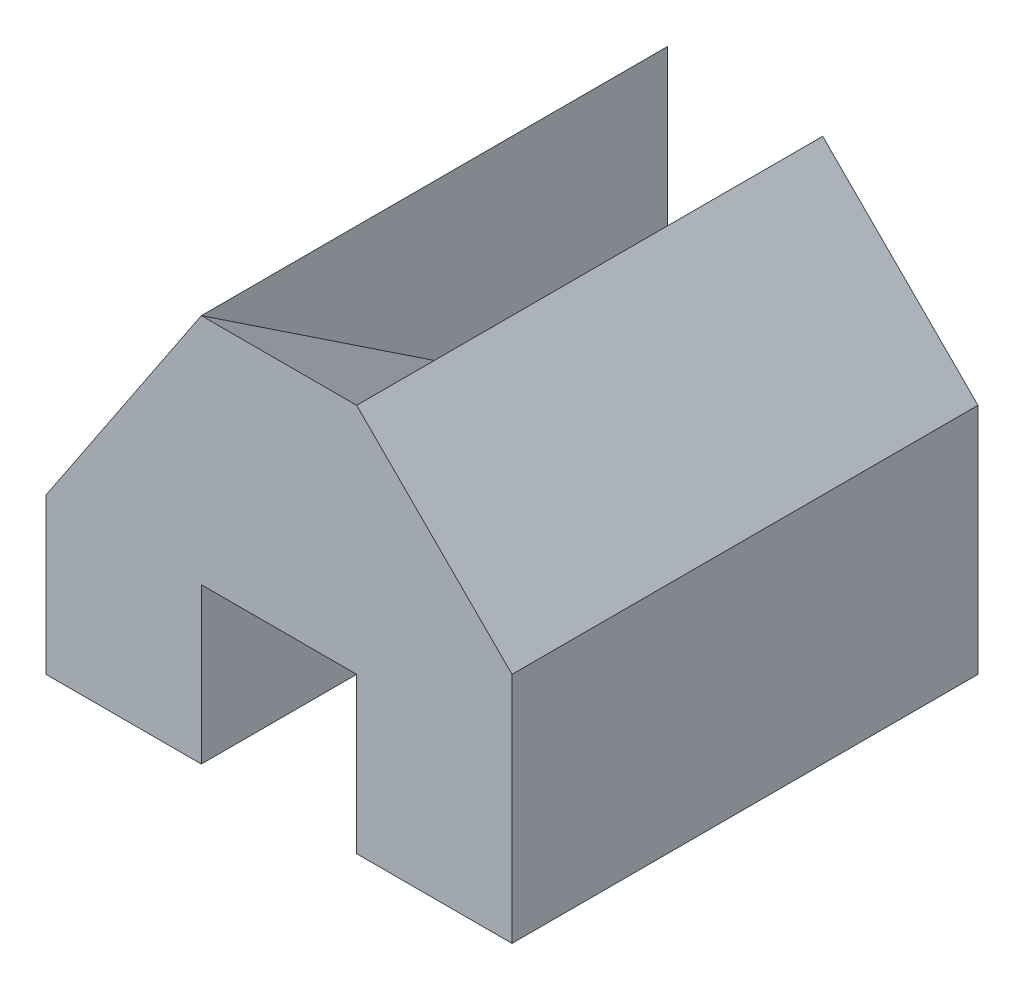
ISO-10303-21;
HEADER;
FILE_DESCRIPTION(('STEP AP214'),'2;1');
FILE_NAME('part.step','',(''),(''),'','','');
FILE_SCHEMA(('AUTOMOTIVE_DESIGN { 1 0 10303 214 1 1 1 1 }'));
ENDSEC;
DATA;
#1=APPLICATION_CONTEXT('core data for automotive mechanical design processes');
#2=APPLICATION_PROTOCOL_DEFINITION('international standard','automotive_design',2000,#1);
#3=PRODUCT_CONTEXT('',#1,'mechanical');
#4=PRODUCT('Part','Part','',(#3));
#5=PRODUCT_RELATED_PRODUCT_CATEGORY('part','',(#4));
#6=PRODUCT_DEFINITION_FORMATION('','',#4);
#7=PRODUCT_DEFINITION_CONTEXT('part definition',#1,'design');
#8=PRODUCT_DEFINITION('design','',#6,#7);
#9=PRODUCT_DEFINITION_SHAPE('','',#8);
#10=(LENGTH_UNIT() NAMED_UNIT(*) SI_UNIT(.MILLI.,.METRE.));
#11=(NAMED_UNIT(*) PLANE_ANGLE_UNIT() SI_UNIT($,.RADIAN.));
#12=(NAMED_UNIT(*) SI_UNIT($,.STERADIAN.) SOLID_ANGLE_UNIT());
#13=UNCERTAINTY_MEASURE_WITH_UNIT(LENGTH_MEASURE(1.E-05),#10,'distance_accuracy_value','');
#14=(GEOMETRIC_REPRESENTATION_CONTEXT(3) GLOBAL_UNCERTAINTY_ASSIGNED_CONTEXT((#13)) GLOBAL_UNIT_ASSIGNED_CONTEXT((#10,
#11,#12)) REPRESENTATION_CONTEXT('',''));
#15=CARTESIAN_POINT('',(0.,0.,0.));
#16=DIRECTION('',(0.,0.,1.));
#17=DIRECTION('',(1.,0.,0.));
#18=AXIS2_PLACEMENT_3D('',#15,#16,#17);
#19=CARTESIAN_POINT('',(-3.,5.,-3.));
#20=DIRECTION('',(0.,0.,1.));
#21=DIRECTION('',(1.,0.,0.));
#22=AXIS2_PLACEMENT_3D('',#19,#20,#21);
#23=PLANE('',#22);
#24=DIRECTION('',(-0.554700196225229,-0.832050294337843,0.));
#25=VECTOR('',#24,1.);
#26=CARTESIAN_POINT('',(-1.61538461538462,4.07692307692308,-3.));
#27=LINE('',#26,#25);
#28=CARTESIAN_POINT('',(-1.,5.,-3.));
#29=VERTEX_POINT('',#28);
#30=CARTESIAN_POINT('',(-3.,2.,-3.));
#31=VERTEX_POINT('',#30);
#32=EDGE_CURVE('E134',#29,#31,#27,.T.);
#33=ORIENTED_EDGE('',*,*,#32,.F.);
#34=DIRECTION('',(0.,1.,0.));
#35=VECTOR('',#34,1.);
#36=CARTESIAN_POINT('',(-1.,0.,-3.));
#37=LINE('',#36,#35);
#38=CARTESIAN_POINT('',(-1.,0.999999999999999,-3.));
#39=VERTEX_POINT('',#38);
#40=EDGE_CURVE('E185',#39,#29,#37,.T.);
#41=ORIENTED_EDGE('',*,*,#40,.F.);
#42=DIRECTION('',(1.,0.,0.));
#43=VECTOR('',#42,1.);
#44=CARTESIAN_POINT('',(-1.,0.999999999999999,-3.));
#45=LINE('',#44,#43);
#46=CARTESIAN_POINT('',(1.,0.999999999999999,-3.));
#47=VERTEX_POINT('',#46);
#48=EDGE_CURVE('E168',#39,#47,#45,.T.);
#49=ORIENTED_EDGE('',*,*,#48,.T.);
#50=DIRECTION('',(0.,1.,0.));
#51=VECTOR('',#50,1.);
#52=CARTESIAN_POINT('',(1.,0.,-3.));
#53=LINE('',#52,#51);
#54=CARTESIAN_POINT('',(1.,5.,-3.));
#55=VERTEX_POINT('',#54);
#56=EDGE_CURVE('E176',#47,#55,#53,.T.);
#57=ORIENTED_EDGE('',*,*,#56,.T.);
#58=DIRECTION('',(0.707106781186548,-0.707106781186548,0.));
#59=VECTOR('',#58,1.);
#60=CARTESIAN_POINT('',(-1.,7.,-3.));
#61=LINE('',#60,#59);
#62=CARTESIAN_POINT('',(3.,3.,-3.));
#63=VERTEX_POINT('',#62);
#64=EDGE_CURVE('E138',#55,#63,#61,.T.);
#65=ORIENTED_EDGE('',*,*,#64,.T.);
#66=DIRECTION('',(0.,-1.,0.));
#67=VECTOR('',#66,1.);
#68=CARTESIAN_POINT('',(3.,5.,-3.));
#69=LINE('',#68,#67);
#70=CARTESIAN_POINT('',(3.,0.,-3.));
#71=VERTEX_POINT('',#70);
#72=EDGE_CURVE('E12',#63,#71,#69,.T.);
#73=ORIENTED_EDGE('',*,*,#72,.T.);
#74=DIRECTION('',(-1.,0.,0.));
#75=VECTOR('',#74,1.);
#76=CARTESIAN_POINT('',(-3.,0.,-3.));
#77=LINE('',#76,#75);
#78=CARTESIAN_POINT('',(1.,0.,-3.));
#79=VERTEX_POINT('',#78);
#80=EDGE_CURVE('E162',#71,#79,#77,.T.);
#81=ORIENTED_EDGE('',*,*,#80,.T.);
#82=DIRECTION('',(1.,0.,0.));
#83=VECTOR('',#82,1.);
#84=CARTESIAN_POINT('',(-1.,0.,-3.));
#85=LINE('',#84,#83);
#86=CARTESIAN_POINT('',(-1.,0.,-3.));
#87=VERTEX_POINT('',#86);
#88=EDGE_CURVE('E182',#87,#79,#85,.T.);
#89=ORIENTED_EDGE('',*,*,#88,.F.);
#90=CARTESIAN_POINT('',(-3.,0.,-3.));
#91=VERTEX_POINT('',#90);
#92=EDGE_CURVE('E165',#87,#91,#77,.T.);
#93=ORIENTED_EDGE('',*,*,#92,.T.);
#94=DIRECTION('',(0.,-1.,0.));
#95=VECTOR('',#94,1.);
#96=CARTESIAN_POINT('',(-3.,5.,-3.));
#97=LINE('',#96,#95);
#98=EDGE_CURVE('E59',#31,#91,#97,.T.);
#99=ORIENTED_EDGE('',*,*,#98,.F.);
#100=EDGE_LOOP('',(#33,#41,#49,#57,#65,#73,#81,#89,#93,#99));
#101=FACE_BOUND('',#100,.T.);
#102=ADVANCED_FACE('F51',(#101),#23,.F.);
#103=CARTESIAN_POINT('',(-3.,5.,3.));
#104=DIRECTION('',(0.,0.,-1.));
#105=DIRECTION('',(-1.,0.,0.));
#106=AXIS2_PLACEMENT_3D('',#103,#104,#105);
#107=PLANE('',#106);
#108=DIRECTION('',(-0.554700196225229,-0.832050294337844,0.));
#109=VECTOR('',#108,1.);
#110=CARTESIAN_POINT('',(-3.,2.,3.));
#111=LINE('',#110,#109);
#112=CARTESIAN_POINT('',(-1.,5.,3.));
#113=VERTEX_POINT('',#112);
#114=CARTESIAN_POINT('',(-3.,2.,3.));
#115=VERTEX_POINT('',#114);
#116=EDGE_CURVE('E131',#113,#115,#111,.T.);
#117=ORIENTED_EDGE('',*,*,#116,.T.);
#118=DIRECTION('',(0.,-1.,0.));
#119=VECTOR('',#118,1.);
#120=CARTESIAN_POINT('',(-3.,5.,3.));
#121=LINE('',#120,#119);
#122=CARTESIAN_POINT('',(-3.,0.,3.));
#123=VERTEX_POINT('',#122);
#124=EDGE_CURVE('E144',#115,#123,#121,.T.);
#125=ORIENTED_EDGE('',*,*,#124,.T.);
#126=DIRECTION('',(1.,0.,0.));
#127=VECTOR('',#126,1.);
#128=CARTESIAN_POINT('',(-3.,0.,3.));
#129=LINE('',#128,#127);
#130=CARTESIAN_POINT('',(-1.,0.,3.));
#131=VERTEX_POINT('',#130);
#132=EDGE_CURVE('E156',#123,#131,#129,.T.);
#133=ORIENTED_EDGE('',*,*,#132,.T.);
#134=DIRECTION('',(0.,-1.,0.));
#135=VECTOR('',#134,1.);
#136=CARTESIAN_POINT('',(-1.,0.,3.));
#137=LINE('',#136,#135);
#138=CARTESIAN_POINT('',(-1.,2.,3.));
#139=VERTEX_POINT('',#138);
#140=EDGE_CURVE('E205',#139,#131,#137,.T.);
#141=ORIENTED_EDGE('',*,*,#140,.F.);
#142=DIRECTION('',(1.,0.,0.));
#143=VECTOR('',#142,1.);
#144=CARTESIAN_POINT('',(-1.,2.,3.));
#145=LINE('',#144,#143);
#146=CARTESIAN_POINT('',(1.,2.,3.));
#147=VERTEX_POINT('',#146);
#148=EDGE_CURVE('E190',#139,#147,#145,.T.);
#149=ORIENTED_EDGE('',*,*,#148,.T.);
#150=DIRECTION('',(0.,-1.,0.));
#151=VECTOR('',#150,1.);
#152=CARTESIAN_POINT('',(1.,0.,3.));
#153=LINE('',#152,#151);
#154=CARTESIAN_POINT('',(1.,0.,3.));
#155=VERTEX_POINT('',#154);
#156=EDGE_CURVE('E199',#147,#155,#153,.T.);
#157=ORIENTED_EDGE('',*,*,#156,.T.);
#158=CARTESIAN_POINT('',(3.,0.,3.));
#159=VERTEX_POINT('',#158);
#160=EDGE_CURVE('E160',#155,#159,#129,.T.);
#161=ORIENTED_EDGE('',*,*,#160,.T.);
#162=DIRECTION('',(0.,-1.,0.));
#163=VECTOR('',#162,1.);
#164=CARTESIAN_POINT('',(3.,5.,3.));
#165=LINE('',#164,#163);
#166=CARTESIAN_POINT('',(3.,3.,3.));
#167=VERTEX_POINT('',#166);
#168=EDGE_CURVE('E74',#167,#159,#165,.T.);
#169=ORIENTED_EDGE('',*,*,#168,.F.);
#170=DIRECTION('',(0.707106781186548,-0.707106781186548,0.));
#171=VECTOR('',#170,1.);
#172=CARTESIAN_POINT('',(3.,3.,3.));
#173=LINE('',#172,#171);
#174=CARTESIAN_POINT('',(1.,5.,3.));
#175=VERTEX_POINT('',#174);
#176=EDGE_CURVE('E212',#175,#167,#173,.T.);
#177=ORIENTED_EDGE('',*,*,#176,.F.);
#178=DIRECTION('',(1.,0.,0.));
#179=VECTOR('',#178,1.);
#180=CARTESIAN_POINT('',(-1.,5.,3.));
#181=LINE('',#180,#179);
#182=EDGE_CURVE('E148',#113,#175,#181,.T.);
#183=ORIENTED_EDGE('',*,*,#182,.F.);
#184=EDGE_LOOP('',(#117,#125,#133,#141,#149,#157,#161,#169,#177,#183));
#185=FACE_BOUND('',#184,.T.);
#186=ADVANCED_FACE('F142',(#185),#107,.F.);
#187=CARTESIAN_POINT('',(-3.,5.,3.));
#188=DIRECTION('',(1.,0.,0.));
#189=DIRECTION('',(0.,0.,-1.));
#190=AXIS2_PLACEMENT_3D('',#187,#188,#189);
#191=PLANE('',#190);
#192=DIRECTION('',(0.,0.,1.));
#193=VECTOR('',#192,1.);
#194=CARTESIAN_POINT('',(-3.,2.,-9.));
#195=LINE('',#194,#193);
#196=EDGE_CURVE('E128',#31,#115,#195,.T.);
#197=ORIENTED_EDGE('',*,*,#196,.F.);
#198=ORIENTED_EDGE('',*,*,#98,.T.);
#199=DIRECTION('',(0.,0.,1.));
#200=VECTOR('',#199,1.);
#201=CARTESIAN_POINT('',(-3.,0.,3.));
#202=LINE('',#201,#200);
#203=EDGE_CURVE('E153',#91,#123,#202,.T.);
#204=ORIENTED_EDGE('',*,*,#203,.T.);
#205=ORIENTED_EDGE('',*,*,#124,.F.);
#206=EDGE_LOOP('',(#197,#198,#204,#205));
#207=FACE_BOUND('',#206,.T.);
#208=ADVANCED_FACE('F151',(#207),#191,.F.);
#209=CARTESIAN_POINT('',(0.,0.,0.));
#210=DIRECTION('',(0.,-1.,0.));
#211=DIRECTION('',(0.,0.,-1.));
#212=AXIS2_PLACEMENT_3D('',#209,#210,#211);
#213=PLANE('',#212);
#214=ORIENTED_EDGE('',*,*,#92,.F.);
#215=DIRECTION('',(0.,0.,-1.));
#216=VECTOR('',#215,1.);
#217=CARTESIAN_POINT('',(-1.,0.,0.));
#218=LINE('',#217,#216);
#219=EDGE_CURVE('E193',#131,#87,#218,.T.);
#220=ORIENTED_EDGE('',*,*,#219,.F.);
#221=ORIENTED_EDGE('',*,*,#132,.F.);
#222=ORIENTED_EDGE('',*,*,#203,.F.);
#223=EDGE_LOOP('',(#214,#220,#221,#222));
#224=FACE_BOUND('',#223,.T.);
#225=ADVANCED_FACE('F236',(#224),#213,.T.);
#226=CARTESIAN_POINT('',(3.,5.,3.));
#227=DIRECTION('',(-1.,0.,0.));
#228=DIRECTION('',(0.,0.,1.));
#229=AXIS2_PLACEMENT_3D('',#226,#227,#228);
#230=PLANE('',#229);
#231=ORIENTED_EDGE('',*,*,#72,.F.);
#232=DIRECTION('',(0.,0.,1.));
#233=VECTOR('',#232,1.);
#234=CARTESIAN_POINT('',(3.,3.,-9.));
#235=LINE('',#234,#233);
#236=EDGE_CURVE('E149',#63,#167,#235,.T.);
#237=ORIENTED_EDGE('',*,*,#236,.T.);
#238=ORIENTED_EDGE('',*,*,#168,.T.);
#239=DIRECTION('',(0.,0.,-1.));
#240=VECTOR('',#239,1.);
#241=CARTESIAN_POINT('',(3.,0.,3.));
#242=LINE('',#241,#240);
#243=EDGE_CURVE('E166',#159,#71,#242,.T.);
#244=ORIENTED_EDGE('',*,*,#243,.T.);
#245=EDGE_LOOP('',(#231,#237,#238,#244));
#246=FACE_BOUND('',#245,.T.);
#247=ADVANCED_FACE('F53',(#246),#230,.F.);
#248=DIRECTION('',(0.,0.,-1.));
#249=VECTOR('',#248,1.);
#250=CARTESIAN_POINT('',(1.,0.,0.));
#251=LINE('',#250,#249);
#252=EDGE_CURVE('E195',#155,#79,#251,.T.);
#253=ORIENTED_EDGE('',*,*,#252,.T.);
#254=ORIENTED_EDGE('',*,*,#80,.F.);
#255=ORIENTED_EDGE('',*,*,#243,.F.);
#256=ORIENTED_EDGE('',*,*,#160,.F.);
#257=EDGE_LOOP('',(#253,#254,#255,#256));
#258=FACE_BOUND('',#257,.T.);
#259=ADVANCED_FACE('F222',(#258),#213,.T.);
#260=CARTESIAN_POINT('',(-1.,0.9,-0.3));
#261=DIRECTION('',(0.,-0.948683298050514,0.316227766016838));
#262=DIRECTION('',(0.,-0.316227766016838,-0.948683298050514));
#263=AXIS2_PLACEMENT_3D('',#260,#261,#262);
#264=PLANE('',#263);
#265=DIRECTION('',(0.,-0.316227766016838,-0.948683298050514));
#266=VECTOR('',#265,1.);
#267=CARTESIAN_POINT('',(1.,0.9,-0.3));
#268=LINE('',#267,#266);
#269=EDGE_CURVE('E66',#147,#79,#268,.T.);
#270=ORIENTED_EDGE('',*,*,#269,.F.);
#271=ORIENTED_EDGE('',*,*,#148,.F.);
#272=DIRECTION('',(0.,-0.316227766016838,-0.948683298050514));
#273=VECTOR('',#272,1.);
#274=CARTESIAN_POINT('',(-1.,0.9,-0.3));
#275=LINE('',#274,#273);
#276=EDGE_CURVE('E198',#139,#87,#275,.T.);
#277=ORIENTED_EDGE('',*,*,#276,.T.);
#278=ORIENTED_EDGE('',*,*,#88,.T.);
#279=EDGE_LOOP('',(#270,#271,#277,#278));
#280=FACE_BOUND('',#279,.T.);
#281=ADVANCED_FACE('F242',(#280),#264,.T.);
#282=CARTESIAN_POINT('',(-1.,0.,0.));
#283=DIRECTION('',(1.,0.,0.));
#284=DIRECTION('',(0.,0.,-1.));
#285=AXIS2_PLACEMENT_3D('',#282,#283,#284);
#286=PLANE('',#285);
#287=ORIENTED_EDGE('',*,*,#276,.F.);
#288=ORIENTED_EDGE('',*,*,#140,.T.);
#289=ORIENTED_EDGE('',*,*,#219,.T.);
#290=EDGE_LOOP('',(#287,#288,#289));
#291=FACE_BOUND('',#290,.T.);
#292=ADVANCED_FACE('F240',(#291),#286,.T.);
#293=CARTESIAN_POINT('',(1.,0.,0.));
#294=DIRECTION('',(1.,0.,0.));
#295=DIRECTION('',(0.,0.,-1.));
#296=AXIS2_PLACEMENT_3D('',#293,#294,#295);
#297=PLANE('',#296);
#298=ORIENTED_EDGE('',*,*,#269,.T.);
#299=ORIENTED_EDGE('',*,*,#252,.F.);
#300=ORIENTED_EDGE('',*,*,#156,.F.);
#301=EDGE_LOOP('',(#298,#299,#300));
#302=FACE_BOUND('',#301,.T.);
#303=ADVANCED_FACE('F243',(#302),#297,.F.);
#304=CARTESIAN_POINT('',(-1.,2.07692307692308,-1.38461538461538));
#305=DIRECTION('',(0.,-0.832050294337844,0.554700196225229));
#306=DIRECTION('',(0.,-0.554700196225229,-0.832050294337844));
#307=AXIS2_PLACEMENT_3D('',#304,#305,#306);
#308=PLANE('',#307);
#309=DIRECTION('',(0.,-0.554700196225229,-0.832050294337844));
#310=VECTOR('',#309,1.);
#311=CARTESIAN_POINT('',(1.,2.07692307692308,-1.38461538461538));
#312=LINE('',#311,#310);
#313=EDGE_CURVE('E179',#175,#47,#312,.T.);
#314=ORIENTED_EDGE('',*,*,#313,.T.);
#315=ORIENTED_EDGE('',*,*,#48,.F.);
#316=DIRECTION('',(0.,-0.554700196225229,-0.832050294337844));
#317=VECTOR('',#316,1.);
#318=CARTESIAN_POINT('',(-1.,2.07692307692308,-1.38461538461538));
#319=LINE('',#318,#317);
#320=EDGE_CURVE('E175',#113,#39,#319,.T.);
#321=ORIENTED_EDGE('',*,*,#320,.F.);
#322=ORIENTED_EDGE('',*,*,#182,.T.);
#323=EDGE_LOOP('',(#314,#315,#321,#322));
#324=FACE_BOUND('',#323,.T.);
#325=ADVANCED_FACE('F229',(#324),#308,.F.);
#326=CARTESIAN_POINT('',(-1.,0.,0.));
#327=DIRECTION('',(1.,0.,0.));
#328=DIRECTION('',(0.,0.,-1.));
#329=AXIS2_PLACEMENT_3D('',#326,#327,#328);
#330=PLANE('',#329);
#331=ORIENTED_EDGE('',*,*,#320,.T.);
#332=ORIENTED_EDGE('',*,*,#40,.T.);
#333=DIRECTION('',(0.,0.,1.));
#334=VECTOR('',#333,1.);
#335=CARTESIAN_POINT('',(-1.,5.,0.));
#336=LINE('',#335,#334);
#337=EDGE_CURVE('E171',#29,#113,#336,.T.);
#338=ORIENTED_EDGE('',*,*,#337,.T.);
#339=EDGE_LOOP('',(#331,#332,#338));
#340=FACE_BOUND('',#339,.T.);
#341=ADVANCED_FACE('F232',(#340),#330,.T.);
#342=CARTESIAN_POINT('',(1.,0.,0.));
#343=DIRECTION('',(1.,0.,0.));
#344=DIRECTION('',(0.,0.,-1.));
#345=AXIS2_PLACEMENT_3D('',#342,#343,#344);
#346=PLANE('',#345);
#347=ORIENTED_EDGE('',*,*,#313,.F.);
#348=DIRECTION('',(0.,0.,1.));
#349=VECTOR('',#348,1.);
#350=CARTESIAN_POINT('',(1.,5.,0.));
#351=LINE('',#350,#349);
#352=EDGE_CURVE('E173',#55,#175,#351,.T.);
#353=ORIENTED_EDGE('',*,*,#352,.F.);
#354=ORIENTED_EDGE('',*,*,#56,.F.);
#355=EDGE_LOOP('',(#347,#353,#354));
#356=FACE_BOUND('',#355,.T.);
#357=ADVANCED_FACE('F227',(#356),#346,.F.);
#358=CARTESIAN_POINT('',(3.,3.,-9.));
#359=DIRECTION('',(-0.707106781186547,-0.707106781186547,0.));
#360=DIRECTION('',(0.707106781186548,-0.707106781186548,0.));
#361=AXIS2_PLACEMENT_3D('',#358,#359,#360);
#362=PLANE('',#361);
#363=ORIENTED_EDGE('',*,*,#352,.T.);
#364=ORIENTED_EDGE('',*,*,#176,.T.);
#365=ORIENTED_EDGE('',*,*,#236,.F.);
#366=ORIENTED_EDGE('',*,*,#64,.F.);
#367=EDGE_LOOP('',(#363,#364,#365,#366));
#368=FACE_BOUND('',#367,.T.);
#369=ADVANCED_FACE('F214',(#368),#362,.F.);
#370=CARTESIAN_POINT('',(-3.,2.,-9.));
#371=DIRECTION('',(-0.832050294337844,0.554700196225229,0.));
#372=DIRECTION('',(-0.554700196225229,-0.832050294337843,0.));
#373=AXIS2_PLACEMENT_3D('',#370,#371,#372);
#374=PLANE('',#373);
#375=ORIENTED_EDGE('',*,*,#32,.T.);
#376=ORIENTED_EDGE('',*,*,#196,.T.);
#377=ORIENTED_EDGE('',*,*,#116,.F.);
#378=ORIENTED_EDGE('',*,*,#337,.F.);
#379=EDGE_LOOP('',(#375,#376,#377,#378));
#380=FACE_BOUND('',#379,.T.);
#381=ADVANCED_FACE('F130',(#380),#374,.T.);
#382=CLOSED_SHELL('',(#102,#186,#208,#225,#247,#259,#281,#292,#303,#325,#341,#357,#369,#381));
#383=MANIFOLD_SOLID_BREP('B2',#382);
#384=ADVANCED_BREP_SHAPE_REPRESENTATION('',(#18,#383),#14);
#385=SHAPE_DEFINITION_REPRESENTATION(#9,#384);
ENDSEC;
END-ISO-10303-21;
